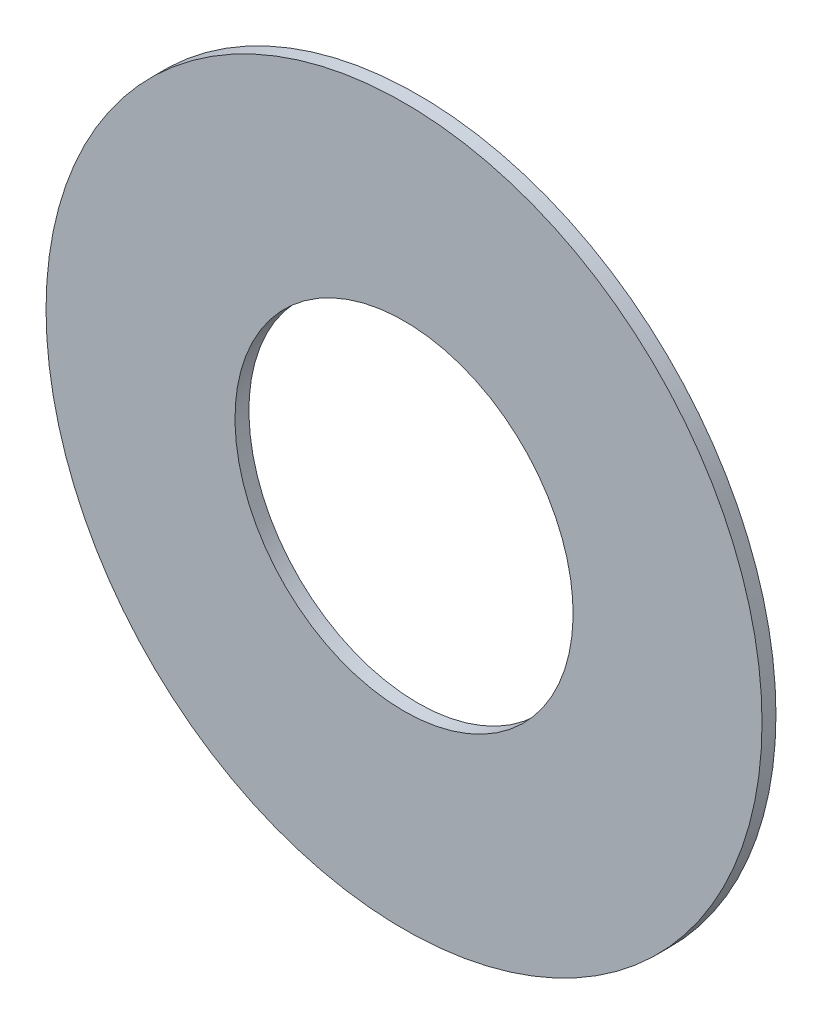
ISO-10303-21;
HEADER;
FILE_DESCRIPTION(('STEP AP214'),'2;1');
FILE_NAME('part.step','',(''),(''),'','','');
FILE_SCHEMA(('AUTOMOTIVE_DESIGN { 1 0 10303 214 1 1 1 1 }'));
ENDSEC;
DATA;
#1=APPLICATION_CONTEXT('core data for automotive mechanical design processes');
#2=APPLICATION_PROTOCOL_DEFINITION('international standard','automotive_design',2000,#1);
#3=PRODUCT_CONTEXT('',#1,'mechanical');
#4=PRODUCT('Part','Part','',(#3));
#5=PRODUCT_RELATED_PRODUCT_CATEGORY('part','',(#4));
#6=PRODUCT_DEFINITION_FORMATION('','',#4);
#7=PRODUCT_DEFINITION_CONTEXT('part definition',#1,'design');
#8=PRODUCT_DEFINITION('design','',#6,#7);
#9=PRODUCT_DEFINITION_SHAPE('','',#8);
#10=(LENGTH_UNIT() NAMED_UNIT(*) SI_UNIT(.MILLI.,.METRE.));
#11=(NAMED_UNIT(*) PLANE_ANGLE_UNIT() SI_UNIT($,.RADIAN.));
#12=(NAMED_UNIT(*) SI_UNIT($,.STERADIAN.) SOLID_ANGLE_UNIT());
#13=UNCERTAINTY_MEASURE_WITH_UNIT(LENGTH_MEASURE(1.E-05),#10,'distance_accuracy_value','');
#14=(GEOMETRIC_REPRESENTATION_CONTEXT(3) GLOBAL_UNCERTAINTY_ASSIGNED_CONTEXT((#13)) GLOBAL_UNIT_ASSIGNED_CONTEXT((#10,
#11,#12)) REPRESENTATION_CONTEXT('',''));
#15=CARTESIAN_POINT('',(0.,0.,0.));
#16=DIRECTION('',(0.,0.,1.));
#17=DIRECTION('',(1.,0.,0.));
#18=AXIS2_PLACEMENT_3D('',#15,#16,#17);
#19=CARTESIAN_POINT('',(117.1498,-71.2108,-0.045));
#20=DIRECTION('',(0.,0.,-1.));
#21=DIRECTION('',(0.,-1.,0.));
#22=AXIS2_PLACEMENT_3D('',#19,#20,#21);
#23=CYLINDRICAL_SURFACE('',#22,0.425);
#24=CARTESIAN_POINT('',(117.1498,-71.2108,1.67));
#25=DIRECTION('',(0.,0.,-1.));
#26=DIRECTION('',(0.,-1.,0.));
#27=AXIS2_PLACEMENT_3D('',#24,#25,#26);
#28=CIRCLE('',#27,0.425);
#29=CARTESIAN_POINT('',(117.1498,-71.6358,1.67));
#30=VERTEX_POINT('',#29);
#31=EDGE_CURVE('E25',#30,#30,#28,.T.);
#32=ORIENTED_EDGE('',*,*,#31,.T.);
#33=DIRECTION('',(0.,0.,1.));
#34=VECTOR('',#33,1.);
#35=CARTESIAN_POINT('',(117.1498,-71.6358,-0.045));
#36=LINE('',#35,#34);
#37=CARTESIAN_POINT('',(117.1498,-71.6358,1.705));
#38=VERTEX_POINT('',#37);
#39=EDGE_CURVE('E11',#30,#38,#36,.T.);
#40=ORIENTED_EDGE('',*,*,#39,.T.);
#41=CARTESIAN_POINT('',(117.1498,-71.2108,1.705));
#42=DIRECTION('',(0.,0.,-1.));
#43=DIRECTION('',(0.,-1.,0.));
#44=AXIS2_PLACEMENT_3D('',#41,#42,#43);
#45=CIRCLE('',#44,0.425);
#46=EDGE_CURVE('E69',#38,#38,#45,.T.);
#47=ORIENTED_EDGE('',*,*,#46,.F.);
#48=ORIENTED_EDGE('',*,*,#39,.F.);
#49=EDGE_LOOP('',(#32,#40,#47,#48));
#50=FACE_BOUND('',#49,.T.);
#51=ADVANCED_FACE('F17',(#50),#23,.F.);
#52=CARTESIAN_POINT('',(117.1498,-71.2108,1.67));
#53=DIRECTION('',(0.,0.,1.));
#54=DIRECTION('',(1.,0.,0.));
#55=AXIS2_PLACEMENT_3D('',#52,#53,#54);
#56=PLANE('',#55);
#57=ORIENTED_EDGE('',*,*,#31,.F.);
#58=EDGE_LOOP('',(#57));
#59=FACE_BOUND('',#58,.T.);
#60=CARTESIAN_POINT('',(117.1498,-71.2108,1.67));
#61=DIRECTION('',(0.,0.,1.));
#62=DIRECTION('',(1.,0.,0.));
#63=AXIS2_PLACEMENT_3D('',#60,#61,#62);
#64=CIRCLE('',#63,0.9);
#65=CARTESIAN_POINT('',(118.0498,-71.2108,1.67));
#66=VERTEX_POINT('',#65);
#67=EDGE_CURVE('E56',#66,#66,#64,.T.);
#68=ORIENTED_EDGE('',*,*,#67,.F.);
#69=EDGE_LOOP('',(#68));
#70=FACE_BOUND('',#69,.T.);
#71=ADVANCED_FACE('F76',(#59,#70),#56,.F.);
#72=CARTESIAN_POINT('',(117.1498,-71.2108,1.705));
#73=DIRECTION('',(0.,0.,1.));
#74=DIRECTION('',(1.,0.,0.));
#75=AXIS2_PLACEMENT_3D('',#72,#73,#74);
#76=PLANE('',#75);
#77=ORIENTED_EDGE('',*,*,#46,.T.);
#78=EDGE_LOOP('',(#77));
#79=FACE_BOUND('',#78,.T.);
#80=CARTESIAN_POINT('',(117.1498,-71.2108,1.705));
#81=DIRECTION('',(0.,0.,1.));
#82=DIRECTION('',(1.,0.,0.));
#83=AXIS2_PLACEMENT_3D('',#80,#81,#82);
#84=CIRCLE('',#83,0.9);
#85=CARTESIAN_POINT('',(118.0498,-71.2108,1.705));
#86=VERTEX_POINT('',#85);
#87=EDGE_CURVE('E54',#86,#86,#84,.T.);
#88=ORIENTED_EDGE('',*,*,#87,.T.);
#89=EDGE_LOOP('',(#88));
#90=FACE_BOUND('',#89,.T.);
#91=ADVANCED_FACE('F60',(#79,#90),#76,.T.);
#92=CARTESIAN_POINT('',(117.1498,-71.2108,1.67));
#93=DIRECTION('',(0.,0.,1.));
#94=DIRECTION('',(1.,0.,0.));
#95=AXIS2_PLACEMENT_3D('',#92,#93,#94);
#96=CYLINDRICAL_SURFACE('',#95,0.9);
#97=ORIENTED_EDGE('',*,*,#87,.F.);
#98=DIRECTION('',(0.,0.,1.));
#99=VECTOR('',#98,1.);
#100=CARTESIAN_POINT('',(118.0498,-71.2108,1.67));
#101=LINE('',#100,#99);
#102=EDGE_CURVE('E51',#66,#86,#101,.T.);
#103=ORIENTED_EDGE('',*,*,#102,.F.);
#104=ORIENTED_EDGE('',*,*,#67,.T.);
#105=ORIENTED_EDGE('',*,*,#102,.T.);
#106=EDGE_LOOP('',(#97,#103,#104,#105));
#107=FACE_BOUND('',#106,.T.);
#108=ADVANCED_FACE('F53',(#107),#96,.T.);
#109=CLOSED_SHELL('',(#51,#71,#91,#108));
#110=MANIFOLD_SOLID_BREP('B1',#109);
#111=ADVANCED_BREP_SHAPE_REPRESENTATION('',(#18,#110),#14);
#112=SHAPE_DEFINITION_REPRESENTATION(#9,#111);
ENDSEC;
END-ISO-10303-21;
